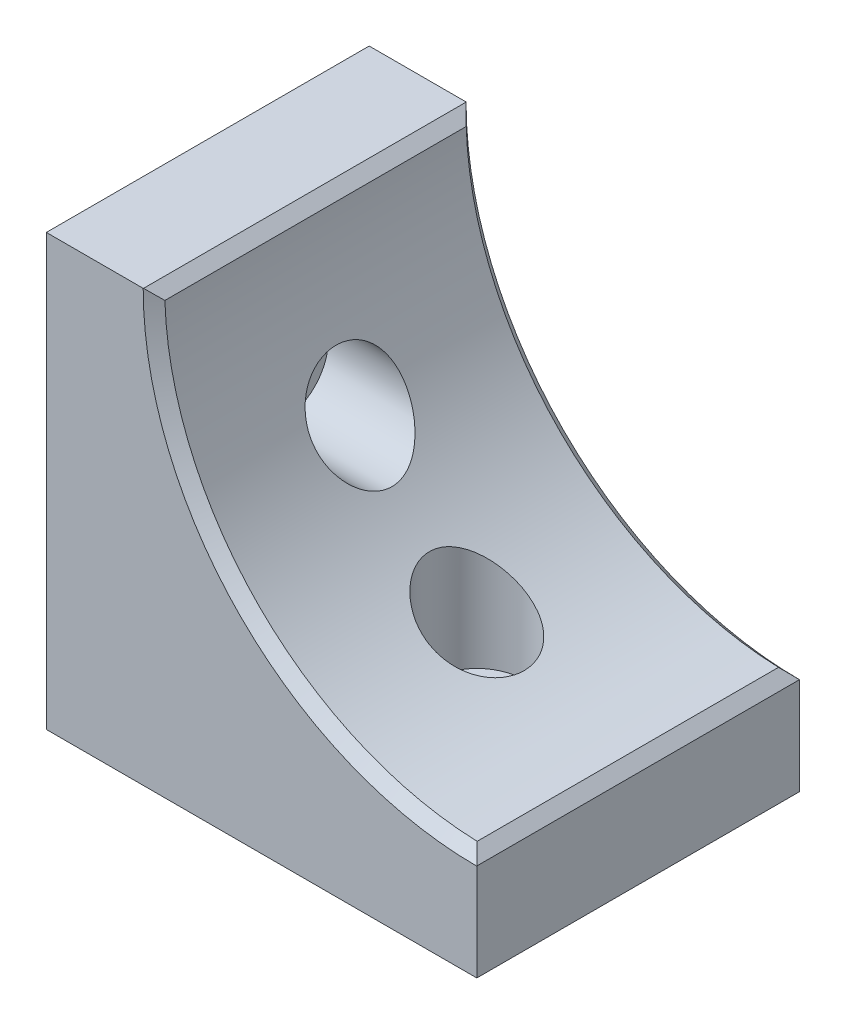
ISO-10303-21;
HEADER;
FILE_DESCRIPTION(('STEP AP214'),'2;1');
FILE_NAME('part.step','',(''),(''),'','','');
FILE_SCHEMA(('AUTOMOTIVE_DESIGN { 1 0 10303 214 1 1 1 1 }'));
ENDSEC;
DATA;
#1=APPLICATION_CONTEXT('core data for automotive mechanical design processes');
#2=APPLICATION_PROTOCOL_DEFINITION('international standard','automotive_design',2000,#1);
#3=PRODUCT_CONTEXT('',#1,'mechanical');
#4=PRODUCT('Part','Part','',(#3));
#5=PRODUCT_RELATED_PRODUCT_CATEGORY('part','',(#4));
#6=PRODUCT_DEFINITION_FORMATION('','',#4);
#7=PRODUCT_DEFINITION_CONTEXT('part definition',#1,'design');
#8=PRODUCT_DEFINITION('design','',#6,#7);
#9=PRODUCT_DEFINITION_SHAPE('','',#8);
#10=(LENGTH_UNIT() NAMED_UNIT(*) SI_UNIT(.MILLI.,.METRE.));
#11=(NAMED_UNIT(*) PLANE_ANGLE_UNIT() SI_UNIT($,.RADIAN.));
#12=(NAMED_UNIT(*) SI_UNIT($,.STERADIAN.) SOLID_ANGLE_UNIT());
#13=UNCERTAINTY_MEASURE_WITH_UNIT(LENGTH_MEASURE(1.E-05),#10,'distance_accuracy_value','');
#14=(GEOMETRIC_REPRESENTATION_CONTEXT(3) GLOBAL_UNCERTAINTY_ASSIGNED_CONTEXT((#13)) GLOBAL_UNIT_ASSIGNED_CONTEXT((#10,
#11,#12)) REPRESENTATION_CONTEXT('',''));
#15=CARTESIAN_POINT('',(0.,0.,0.));
#16=DIRECTION('',(0.,0.,1.));
#17=DIRECTION('',(1.,0.,0.));
#18=AXIS2_PLACEMENT_3D('',#15,#16,#17);
#19=CARTESIAN_POINT('',(50.8,50.8,0.));
#20=DIRECTION('',(0.,0.,1.));
#21=DIRECTION('',(1.,0.,0.));
#22=AXIS2_PLACEMENT_3D('',#19,#20,#21);
#23=PLANE('',#22);
#24=DIRECTION('',(-1.,0.,0.));
#25=VECTOR('',#24,1.);
#26=CARTESIAN_POINT('',(50.8,50.8,0.));
#27=LINE('',#26,#25);
#28=CARTESIAN_POINT('',(11.43,50.8,0.));
#29=VERTEX_POINT('',#28);
#30=CARTESIAN_POINT('',(0.,50.8,0.));
#31=VERTEX_POINT('',#30);
#32=EDGE_CURVE('E113',#29,#31,#27,.T.);
#33=ORIENTED_EDGE('',*,*,#32,.F.);
#34=CARTESIAN_POINT('',(50.8,50.8,0.));
#35=DIRECTION('',(0.,0.,1.));
#36=DIRECTION('',(1.,0.,0.));
#37=AXIS2_PLACEMENT_3D('',#34,#35,#36);
#38=CIRCLE('',#37,39.37);
#39=CARTESIAN_POINT('',(50.8,11.43,0.));
#40=VERTEX_POINT('',#39);
#41=EDGE_CURVE('E333',#29,#40,#38,.T.);
#42=ORIENTED_EDGE('',*,*,#41,.T.);
#43=DIRECTION('',(0.,-1.,0.));
#44=VECTOR('',#43,1.);
#45=CARTESIAN_POINT('',(50.8,50.8,0.));
#46=LINE('',#45,#44);
#47=CARTESIAN_POINT('',(50.8,0.,0.));
#48=VERTEX_POINT('',#47);
#49=EDGE_CURVE('E348',#40,#48,#46,.T.);
#50=ORIENTED_EDGE('',*,*,#49,.T.);
#51=DIRECTION('',(-1.,0.,0.));
#52=VECTOR('',#51,1.);
#53=CARTESIAN_POINT('',(50.8,0.,0.));
#54=LINE('',#53,#52);
#55=CARTESIAN_POINT('',(0.,0.,0.));
#56=VERTEX_POINT('',#55);
#57=EDGE_CURVE('E135',#48,#56,#54,.T.);
#58=ORIENTED_EDGE('',*,*,#57,.T.);
#59=DIRECTION('',(0.,-1.,0.));
#60=VECTOR('',#59,1.);
#61=CARTESIAN_POINT('',(0.,50.8,0.));
#62=LINE('',#61,#60);
#63=EDGE_CURVE('E127',#31,#56,#62,.T.);
#64=ORIENTED_EDGE('',*,*,#63,.F.);
#65=EDGE_LOOP('',(#33,#42,#50,#58,#64));
#66=FACE_BOUND('',#65,.T.);
#67=ADVANCED_FACE('F38',(#66),#23,.F.);
#68=CARTESIAN_POINT('',(0.,50.8,0.));
#69=DIRECTION('',(1.,0.,0.));
#70=DIRECTION('',(0.,0.,-1.));
#71=AXIS2_PLACEMENT_3D('',#68,#69,#70);
#72=PLANE('',#71);
#73=CARTESIAN_POINT('',(0.,31.75,19.05));
#74=DIRECTION('',(1.,0.,0.));
#75=DIRECTION('',(0.,0.,-1.));
#76=AXIS2_PLACEMENT_3D('',#73,#74,#75);
#77=CIRCLE('',#76,3.302);
#78=CARTESIAN_POINT('',(0.,31.75,15.748));
#79=VERTEX_POINT('',#78);
#80=EDGE_CURVE('E367',#79,#79,#77,.F.);
#81=ORIENTED_EDGE('',*,*,#80,.F.);
#82=EDGE_LOOP('',(#81));
#83=FACE_BOUND('',#82,.T.);
#84=DIRECTION('',(0.,0.,1.));
#85=VECTOR('',#84,1.);
#86=CARTESIAN_POINT('',(0.,0.,0.));
#87=LINE('',#86,#85);
#88=CARTESIAN_POINT('',(0.,0.,38.1));
#89=VERTEX_POINT('',#88);
#90=EDGE_CURVE('E356',#56,#89,#87,.T.);
#91=ORIENTED_EDGE('',*,*,#90,.T.);
#92=DIRECTION('',(0.,-1.,0.));
#93=VECTOR('',#92,1.);
#94=CARTESIAN_POINT('',(0.,50.8,38.1));
#95=LINE('',#94,#93);
#96=CARTESIAN_POINT('',(0.,50.8,38.1));
#97=VERTEX_POINT('',#96);
#98=EDGE_CURVE('E130',#97,#89,#95,.T.);
#99=ORIENTED_EDGE('',*,*,#98,.F.);
#100=DIRECTION('',(0.,0.,1.));
#101=VECTOR('',#100,1.);
#102=CARTESIAN_POINT('',(0.,50.8,0.));
#103=LINE('',#102,#101);
#104=EDGE_CURVE('E116',#31,#97,#103,.T.);
#105=ORIENTED_EDGE('',*,*,#104,.F.);
#106=ORIENTED_EDGE('',*,*,#63,.T.);
#107=EDGE_LOOP('',(#91,#99,#105,#106));
#108=FACE_BOUND('',#107,.T.);
#109=ADVANCED_FACE('F126',(#83,#108),#72,.F.);
#110=CARTESIAN_POINT('',(0.,50.8,38.1));
#111=DIRECTION('',(0.,0.,-1.));
#112=DIRECTION('',(-1.,0.,0.));
#113=AXIS2_PLACEMENT_3D('',#110,#111,#112);
#114=PLANE('',#113);
#115=DIRECTION('',(0.,-1.,0.));
#116=VECTOR('',#115,1.);
#117=CARTESIAN_POINT('',(50.8,50.8,38.1));
#118=LINE('',#117,#116);
#119=CARTESIAN_POINT('',(50.8,11.43,38.1));
#120=VERTEX_POINT('',#119);
#121=CARTESIAN_POINT('',(50.8,0.,38.1));
#122=VERTEX_POINT('',#121);
#123=EDGE_CURVE('E140',#120,#122,#118,.T.);
#124=ORIENTED_EDGE('',*,*,#123,.F.);
#125=CARTESIAN_POINT('',(50.8,50.8,38.1));
#126=DIRECTION('',(0.,0.,-1.));
#127=DIRECTION('',(-1.,0.,0.));
#128=AXIS2_PLACEMENT_3D('',#125,#126,#127);
#129=CIRCLE('',#128,39.37);
#130=CARTESIAN_POINT('',(11.43,50.8,38.1));
#131=VERTEX_POINT('',#130);
#132=EDGE_CURVE('E11',#120,#131,#129,.T.);
#133=ORIENTED_EDGE('',*,*,#132,.T.);
#134=DIRECTION('',(1.,0.,0.));
#135=VECTOR('',#134,1.);
#136=CARTESIAN_POINT('',(0.,50.8,38.1));
#137=LINE('',#136,#135);
#138=EDGE_CURVE('E132',#97,#131,#137,.T.);
#139=ORIENTED_EDGE('',*,*,#138,.F.);
#140=ORIENTED_EDGE('',*,*,#98,.T.);
#141=DIRECTION('',(1.,0.,0.));
#142=VECTOR('',#141,1.);
#143=CARTESIAN_POINT('',(0.,0.,38.1));
#144=LINE('',#143,#142);
#145=EDGE_CURVE('E354',#89,#122,#144,.T.);
#146=ORIENTED_EDGE('',*,*,#145,.T.);
#147=EDGE_LOOP('',(#124,#133,#139,#140,#146));
#148=FACE_BOUND('',#147,.T.);
#149=ADVANCED_FACE('F219',(#148),#114,.F.);
#150=CARTESIAN_POINT('',(50.8,50.8,38.1));
#151=DIRECTION('',(-1.,0.,0.));
#152=DIRECTION('',(0.,0.,1.));
#153=AXIS2_PLACEMENT_3D('',#150,#151,#152);
#154=PLANE('',#153);
#155=ORIENTED_EDGE('',*,*,#49,.F.);
#156=DIRECTION('',(0.,0.707106781186546,0.707106781186549));
#157=VECTOR('',#156,1.);
#158=CARTESIAN_POINT('',(50.8,50.8,39.3700000000002));
#159=LINE('',#158,#157);
#160=CARTESIAN_POINT('',(50.8,11.4504892025326,0.020489202532642));
#161=VERTEX_POINT('',#160);
#162=EDGE_CURVE('E342',#40,#161,#159,.T.);
#163=ORIENTED_EDGE('',*,*,#162,.T.);
#164=DIRECTION('',(0.,0.,1.));
#165=VECTOR('',#164,1.);
#166=CARTESIAN_POINT('',(50.8,11.4504892025326,38.1));
#167=LINE('',#166,#165);
#168=CARTESIAN_POINT('',(50.8,11.4504892025326,38.0795107974674));
#169=VERTEX_POINT('',#168);
#170=EDGE_CURVE('E138',#161,#169,#167,.T.);
#171=ORIENTED_EDGE('',*,*,#170,.T.);
#172=DIRECTION('',(0.,-0.707106781186547,0.707106781186548));
#173=VECTOR('',#172,1.);
#174=CARTESIAN_POINT('',(50.8,50.8,-1.26999999999999));
#175=LINE('',#174,#173);
#176=EDGE_CURVE('E136',#169,#120,#175,.T.);
#177=ORIENTED_EDGE('',*,*,#176,.T.);
#178=ORIENTED_EDGE('',*,*,#123,.T.);
#179=DIRECTION('',(0.,0.,-1.));
#180=VECTOR('',#179,1.);
#181=CARTESIAN_POINT('',(50.8,0.,38.1));
#182=LINE('',#181,#180);
#183=EDGE_CURVE('E122',#122,#48,#182,.T.);
#184=ORIENTED_EDGE('',*,*,#183,.T.);
#185=EDGE_LOOP('',(#155,#163,#171,#177,#178,#184));
#186=FACE_BOUND('',#185,.T.);
#187=ADVANCED_FACE('F224',(#186),#154,.F.);
#188=CARTESIAN_POINT('',(0.,50.8,0.));
#189=DIRECTION('',(0.,1.,0.));
#190=DIRECTION('',(0.,0.,1.));
#191=AXIS2_PLACEMENT_3D('',#188,#189,#190);
#192=PLANE('',#191);
#193=DIRECTION('',(0.,0.,-1.));
#194=VECTOR('',#193,1.);
#195=CARTESIAN_POINT('',(11.4504892025327,50.8,0.));
#196=LINE('',#195,#194);
#197=CARTESIAN_POINT('',(11.4504892025327,50.8,38.0795107974674));
#198=VERTEX_POINT('',#197);
#199=CARTESIAN_POINT('',(11.4504892025327,50.8,0.0204892025326421));
#200=VERTEX_POINT('',#199);
#201=EDGE_CURVE('E61',#198,#200,#196,.T.);
#202=ORIENTED_EDGE('',*,*,#201,.T.);
#203=DIRECTION('',(0.707106781186546,0.,0.707106781186549));
#204=VECTOR('',#203,1.);
#205=CARTESIAN_POINT('',(50.8,50.8,39.3700000000002));
#206=LINE('',#205,#204);
#207=EDGE_CURVE('E53',#200,#29,#206,.F.);
#208=ORIENTED_EDGE('',*,*,#207,.T.);
#209=ORIENTED_EDGE('',*,*,#32,.T.);
#210=ORIENTED_EDGE('',*,*,#104,.T.);
#211=ORIENTED_EDGE('',*,*,#138,.T.);
#212=DIRECTION('',(-0.707106781186547,0.,0.707106781186548));
#213=VECTOR('',#212,1.);
#214=CARTESIAN_POINT('',(50.8,50.8,-1.26999999999999));
#215=LINE('',#214,#213);
#216=EDGE_CURVE('E66',#131,#198,#215,.F.);
#217=ORIENTED_EDGE('',*,*,#216,.T.);
#218=EDGE_LOOP('',(#202,#208,#209,#210,#211,#217));
#219=FACE_BOUND('',#218,.T.);
#220=ADVANCED_FACE('F115',(#219),#192,.T.);
#221=CARTESIAN_POINT('',(0.,0.,0.));
#222=DIRECTION('',(0.,1.,0.));
#223=DIRECTION('',(0.,0.,1.));
#224=AXIS2_PLACEMENT_3D('',#221,#222,#223);
#225=PLANE('',#224);
#226=CARTESIAN_POINT('',(31.75,0.,19.05));
#227=DIRECTION('',(0.,1.,0.));
#228=DIRECTION('',(0.,0.,1.));
#229=AXIS2_PLACEMENT_3D('',#226,#227,#228);
#230=CIRCLE('',#229,3.302);
#231=CARTESIAN_POINT('',(31.75,0.,22.352));
#232=VERTEX_POINT('',#231);
#233=EDGE_CURVE('E153',#232,#232,#230,.F.);
#234=ORIENTED_EDGE('',*,*,#233,.F.);
#235=EDGE_LOOP('',(#234));
#236=FACE_BOUND('',#235,.T.);
#237=ORIENTED_EDGE('',*,*,#57,.F.);
#238=ORIENTED_EDGE('',*,*,#183,.F.);
#239=ORIENTED_EDGE('',*,*,#145,.F.);
#240=ORIENTED_EDGE('',*,*,#90,.F.);
#241=EDGE_LOOP('',(#237,#238,#239,#240));
#242=FACE_BOUND('',#241,.T.);
#243=ADVANCED_FACE('F232',(#236,#242),#225,.F.);
#244=CARTESIAN_POINT('',(31.75,8.63599999999999,19.05));
#245=DIRECTION('',(0.,1.,0.));
#246=DIRECTION('',(0.,0.,1.));
#247=AXIS2_PLACEMENT_3D('',#244,#245,#246);
#248=CYLINDRICAL_SURFACE('',#247,5.588);
#249=CARTESIAN_POINT('',(31.75,8.63599999999999,19.05));
#250=DIRECTION('',(0.,1.,0.));
#251=DIRECTION('',(0.,0.,1.));
#252=AXIS2_PLACEMENT_3D('',#249,#250,#251);
#253=CIRCLE('',#252,5.588);
#254=CARTESIAN_POINT('',(31.75,8.63599999999999,24.638));
#255=VERTEX_POINT('',#254);
#256=EDGE_CURVE('E152',#255,#255,#253,.T.);
#257=ORIENTED_EDGE('',*,*,#256,.F.);
#258=EDGE_LOOP('',(#257));
#259=FACE_BOUND('',#258,.T.);
#260=CARTESIAN_POINT('',(33.6719798439574,16.7670611681242,13.8029305817989));
#261=CARTESIAN_POINT('',(33.5045353280294,16.8513310136074,13.7415942827989));
#262=CARTESIAN_POINT('',(33.3352937266387,16.9380603812287,13.6886964796672));
#263=CARTESIAN_POINT('',(32.9946795607733,17.1159166737783,13.5995401492416));
#264=CARTESIAN_POINT('',(32.8233063541464,17.2070449489363,13.5632867672505));
#265=CARTESIAN_POINT('',(32.479775894432,17.3931508591966,13.5071225590476));
#266=CARTESIAN_POINT('',(32.3076180645864,17.4881319623945,13.4872268156782));
#267=CARTESIAN_POINT('',(31.9639354053222,17.6812494966506,13.4634377214319));
#268=CARTESIAN_POINT('',(31.7924108605644,17.7793871902659,13.4595508559772));
#269=CARTESIAN_POINT('',(31.2822756470434,18.0765804804548,13.4712716163644));
#270=CARTESIAN_POINT('',(30.9461809831672,18.2794574455061,13.5099599225219));
#271=CARTESIAN_POINT('',(30.2890471204666,18.6898595169805,13.6459190832213));
#272=CARTESIAN_POINT('',(29.968012180294,18.8973859139663,13.7432064022736));
#273=CARTESIAN_POINT('',(29.4891690133239,19.2167787236106,13.9365348403208));
#274=CARTESIAN_POINT('',(29.3235921599779,19.3291803377568,14.012976848834));
#275=CARTESIAN_POINT('',(28.9999294204498,19.5525096115123,14.1821229911969));
#276=CARTESIAN_POINT('',(28.8418445252106,19.6634370747508,14.274829268699));
#277=CARTESIAN_POINT('',(28.3806086058974,19.9921686219119,14.5769834831149));
#278=CARTESIAN_POINT('',(28.0899830629529,20.2062533020605,14.8106645329883));
#279=CARTESIAN_POINT('',(27.6145771636137,20.5656769122043,15.2805066981059));
#280=CARTESIAN_POINT('',(27.4207368377338,20.7155991137379,15.5041000222447));
#281=CARTESIAN_POINT('',(27.0662413838408,20.9944753592773,15.987691813407));
#282=CARTESIAN_POINT('',(26.9055350408927,21.1234616970082,16.2476330379277));
#283=CARTESIAN_POINT('',(26.6516193745438,21.3298896004888,16.7488114930517));
#284=CARTESIAN_POINT('',(26.5513956758244,21.4124647882096,16.9843214560591));
#285=CARTESIAN_POINT('',(26.4249501562238,21.5174125596772,17.3510689076288));
#286=CARTESIAN_POINT('',(26.3867772968931,21.5492477885212,17.4755953072772));
#287=CARTESIAN_POINT('',(26.3189421849793,21.6059976768297,17.7284619934944));
#288=CARTESIAN_POINT('',(26.2892762685749,21.6309153154557,17.8568006118317));
#289=CARTESIAN_POINT('',(26.2387811232252,21.6734206198714,18.1172990627839));
#290=CARTESIAN_POINT('',(26.2180110288742,21.6909592206228,18.2494784140243));
#291=CARTESIAN_POINT('',(26.1859759796516,21.71804228522,18.5158037532267));
#292=CARTESIAN_POINT('',(26.1747110266998,21.7275867474511,18.649949741586));
#293=CARTESIAN_POINT('',(26.1619129645557,21.7384319316339,18.9190021543603));
#294=CARTESIAN_POINT('',(26.1603771597571,21.7397349370045,19.0539083577774));
#295=CARTESIAN_POINT('',(26.1670611883183,21.7340690041884,19.3232957800423));
#296=CARTESIAN_POINT('',(26.175280323829,21.7271006577179,19.4577770286005));
#297=CARTESIAN_POINT('',(26.1999871654489,21.7061931162384,19.7115630160486));
#298=CARTESIAN_POINT('',(26.2155515319246,21.6930327491756,19.8310234377406));
#299=CARTESIAN_POINT('',(26.2541747473494,21.660454873472,20.0678755756412));
#300=CARTESIAN_POINT('',(26.2772360708962,21.6410352988082,20.1852665952743));
#301=CARTESIAN_POINT('',(26.3571847940822,21.5739208484998,20.533163954169));
#302=CARTESIAN_POINT('',(26.4248578338043,21.5173523011462,20.7596015839899));
#303=CARTESIAN_POINT('',(26.5898490361349,21.3807796837398,21.2084430814242));
#304=CARTESIAN_POINT('',(26.6885505195984,21.2996907069803,21.4299943199561));
#305=CARTESIAN_POINT('',(26.9099911671664,21.1200761073255,21.8530645645592));
#306=CARTESIAN_POINT('',(27.0327486021475,21.0215372364733,22.0545681676422));
#307=CARTESIAN_POINT('',(27.3599589505764,20.7627681286684,22.5239817824309));
#308=CARTESIAN_POINT('',(27.5760116570853,20.5950150026524,22.7797828624883));
#309=CARTESIAN_POINT('',(27.9254451654776,20.330566506813,23.1274576589672));
#310=CARTESIAN_POINT('',(28.0463047874658,20.2401674301591,23.2374521247969));
#311=CARTESIAN_POINT('',(28.2956425915957,20.0560914689852,23.44539464529));
#312=CARTESIAN_POINT('',(28.424120119988,19.9624148660162,23.5433437314461));
#313=CARTESIAN_POINT('',(28.8229154418719,19.6756480024731,23.8211266646407));
#314=CARTESIAN_POINT('',(29.1039459927729,19.4788428288185,23.9822863378972));
#315=CARTESIAN_POINT('',(29.5413766744913,19.1817724996902,24.1855257260071));
#316=CARTESIAN_POINT('',(29.6898746302208,19.0824128244681,24.2468663261037));
#317=CARTESIAN_POINT('',(29.9916378909298,18.883630772773,24.3565678442023));
#318=CARTESIAN_POINT('',(30.1449036733369,18.7842083910038,24.4049274576507));
#319=CARTESIAN_POINT('',(30.4769255947701,18.5722691549849,24.4941283786566));
#320=CARTESIAN_POINT('',(30.6562721068778,18.4598459113109,24.5330006822198));
#321=CARTESIAN_POINT('',(31.0189156298771,18.2367692327839,24.5930156523691));
#322=CARTESIAN_POINT('',(31.2022113713998,18.1261152486007,24.6141639311543));
#323=CARTESIAN_POINT('',(31.5716968319901,17.9073186080819,24.6382244553069));
#324=CARTESIAN_POINT('',(31.757888783893,17.7991780678226,24.6411218524643));
#325=CARTESIAN_POINT('',(32.1315024847891,17.5863976038308,24.6280925538605));
#326=CARTESIAN_POINT('',(32.3189235424427,17.4817558854521,24.612175665658));
#327=CARTESIAN_POINT('',(32.6886196064006,17.2793921488504,24.5616815555394));
#328=CARTESIAN_POINT('',(32.8709020637448,17.181561069782,24.5275987733002));
#329=CARTESIAN_POINT('',(33.2334251985698,16.9907204687633,24.4407247186672));
#330=CARTESIAN_POINT('',(33.4136668700046,16.897708513117,24.3879429970547));
#331=CARTESIAN_POINT('',(33.7702435446701,16.7171991676075,24.263444592495));
#332=CARTESIAN_POINT('',(33.9465802630183,16.6296993242837,24.1917364086068));
#333=CARTESIAN_POINT('',(34.2933535990997,16.4608415676439,24.0293308764034));
#334=CARTESIAN_POINT('',(34.463791130951,16.3794827004148,23.9386364856177));
#335=CARTESIAN_POINT('',(34.7772887876459,16.2325419981447,23.7500797975986));
#336=CARTESIAN_POINT('',(34.9212349202742,16.1662238696086,23.6542609017718));
#337=CARTESIAN_POINT('',(35.2011730828357,16.0392431895015,23.4483325158939));
#338=CARTESIAN_POINT('',(35.3371662954564,15.9785797962075,23.3382251585751));
#339=CARTESIAN_POINT('',(35.5995014515075,15.8632661633133,23.104373287349));
#340=CARTESIAN_POINT('',(35.7258489635187,15.8086124461043,22.9806367440918));
#341=CARTESIAN_POINT('',(35.9673563007142,15.7055571126729,22.7203081643082));
#342=CARTESIAN_POINT('',(36.0825173730485,15.6571547992974,22.5837175642011));
#343=CARTESIAN_POINT('',(36.2875755887621,15.5720223000897,22.315168368058));
#344=CARTESIAN_POINT('',(36.3788550120753,15.5345899110446,22.184484956127));
#345=CARTESIAN_POINT('',(36.5504376114816,15.4649105259815,21.9147997196267));
#346=CARTESIAN_POINT('',(36.630741894007,15.4326630072055,21.7757987356075));
#347=CARTESIAN_POINT('',(36.779443053768,15.3734507644041,21.4905549401246));
#348=CARTESIAN_POINT('',(36.8478440628736,15.3464842068398,21.3443146642993));
#349=CARTESIAN_POINT('',(36.9719795625175,15.2978831724994,21.0456988952552));
#350=CARTESIAN_POINT('',(37.0277145806201,15.2762484736372,20.8933236578814));
#351=CARTESIAN_POINT('',(37.1224133885566,15.2396848215849,20.5945783005061));
#352=CARTESIAN_POINT('',(37.1622802554007,15.2243915772057,20.44853822312));
#353=CARTESIAN_POINT('',(37.230089583053,15.198471215687,20.153312152632));
#354=CARTESIAN_POINT('',(37.2580326460314,15.187843862912,20.0041263187949));
#355=CARTESIAN_POINT('',(37.3017013647577,15.1712688919853,19.7037479334325));
#356=CARTESIAN_POINT('',(37.3174292109676,15.1653204348002,19.5525557466391));
#357=CARTESIAN_POINT('',(37.336511873042,15.1581062125375,19.2492806263582));
#358=CARTESIAN_POINT('',(37.3398667869517,15.1568404103538,19.0971976999385));
#359=CARTESIAN_POINT('',(37.3342530148954,15.1589609499622,18.7977598191406));
#360=CARTESIAN_POINT('',(37.3256429307956,15.162211919406,18.6503970352189));
#361=CARTESIAN_POINT('',(37.2968132686684,15.1731255156665,18.3569254767016));
#362=CARTESIAN_POINT('',(37.2765897858464,15.1807896263241,18.2108171406702));
#363=CARTESIAN_POINT('',(37.2247401627678,15.2005184334756,17.9210072153773));
#364=CARTESIAN_POINT('',(37.1931189925873,15.2125812119128,17.7773046056119));
#365=CARTESIAN_POINT('',(37.1187674682408,15.241098718281,17.4931924060241));
#366=CARTESIAN_POINT('',(37.0760330006639,15.2575550724846,17.3527840565432));
#367=CARTESIAN_POINT('',(36.9798802316746,15.2948321306295,17.0762934665307));
#368=CARTESIAN_POINT('',(36.9264632640266,15.3156522897432,16.9402106883854));
#369=CARTESIAN_POINT('',(36.8094317626486,15.3616316452543,16.6732060898335));
#370=CARTESIAN_POINT('',(36.7458135313782,15.3867924151973,16.5422861622684));
#371=CARTESIAN_POINT('',(36.6090098542305,15.441391173675,16.2865249737404));
#372=CARTESIAN_POINT('',(36.5358269027572,15.4708280472578,16.1616821395292));
#373=CARTESIAN_POINT('',(36.3805270635381,15.5339281312618,15.9187452855139));
#374=CARTESIAN_POINT('',(36.2984068862207,15.5675928985727,15.8006537752657));
#375=CARTESIAN_POINT('',(36.12363392523,15.6400303561165,15.5688054598487));
#376=CARTESIAN_POINT('',(36.0307547788586,15.6789174166269,15.4552550507083));
#377=CARTESIAN_POINT('',(35.837181505224,15.7609486952775,15.2365995436409));
#378=CARTESIAN_POINT('',(35.7364843580261,15.8040945602711,15.1314977414675));
#379=CARTESIAN_POINT('',(35.5282451448907,15.89446508193,14.930346265392));
#380=CARTESIAN_POINT('',(35.4207071020827,15.9416873469938,14.8342913519818));
#381=CARTESIAN_POINT('',(35.1996255956112,16.0400663819765,14.6515436690519));
#382=CARTESIAN_POINT('',(35.0860805125648,16.0912242145545,14.5648534434293));
#383=CARTESIAN_POINT('',(34.7662893928273,16.2373017134574,14.3393984739019));
#384=CARTESIAN_POINT('',(34.5546796827127,16.3361419827205,14.2106349392047));
#385=CARTESIAN_POINT('',(34.120464968254,16.5441817938068,13.9837679627413));
#386=CARTESIAN_POINT('',(33.8978575027763,16.6533836594803,13.8856714201115));
#387=CARTESIAN_POINT('',(33.6719798439574,16.7670611681242,13.8029305817989));
#388=B_SPLINE_CURVE_WITH_KNOTS('',3,(#260,#261,#262,#263,#264,#265,#266,#267,#268,#269,#270,
#271,#272,#273,#274,#275,#276,#277,#278,#279,#280,#281,#282,#283,#284,#285,#286,#287,#288,#289,
#290,#291,#292,#293,#294,#295,#296,#297,#298,#299,#300,#301,#302,#303,#304,#305,#306,#307,#308,
#309,#310,#311,#312,#313,#314,#315,#316,#317,#318,#319,#320,#321,#322,#323,#324,#325,#326,#327,
#328,#329,#330,#331,#332,#333,#334,#335,#336,#337,#338,#339,#340,#341,#342,#343,#344,#345,#346,
#347,#348,#349,#350,#351,#352,#353,#354,#355,#356,#357,#358,#359,#360,#361,#362,#363,#364,#365,
#366,#367,#368,#369,#370,#371,#372,#373,#374,#375,#376,#377,#378,#379,#380,#381,#382,#383,#384,
#385,#386,#387),.UNSPECIFIED.,.T.,.F.,(4,2,2,2,2,2,2,2,2,2,2,2,2,2,2,2,2,2,2,2,2,2,2,2,2,2,2,2,
2,2,2,2,2,2,2,2,2,2,2,2,2,2,2,2,2,2,2,2,2,2,2,2,2,2,2,2,2,2,2,2,2,2,2,4),(0.,0.59143019743791,
1.18304310125731,1.77520090208599,2.36759857081314,3.54585146252315,4.72443556138375,
5.36642340974752,6.00849593662644,7.29078496302428,8.28242618747284,9.27252295480576,
10.0757784277186,10.4775908666943,10.8792299898642,11.2834990460044,11.6877681837963,
12.0919253078656,12.4960535210771,12.8591869552194,13.2224403744609,13.9483281951731,
14.7127598966768,15.4777744623373,16.5948096200641,17.1546365229015,17.7144154521549,
18.8465445116787,19.4129005516023,19.9793134874643,20.6241765766427,21.268835396813,
21.9140186187461,22.5588656661881,23.1869959575326,23.8148058827761,24.4423343638679,
25.0697651659001,25.6246023338844,26.1793567805023,26.7337884999131,27.2881583359105,
27.7787455566503,28.269283283489,28.7596503935079,29.2499970749936,29.7058994237187,
30.1617787459571,30.6175762999307,31.0733702420838,31.5157943669071,31.9583673359779,
32.400747549666,32.8432917370011,33.2857807049057,33.7284304209991,34.1709649270054,
34.6136628734421,35.0684483688447,35.5234104211416,35.9781073406027,36.4329274685207,
37.2305698522643,38.0283915522569),.UNSPECIFIED.);
#389=CARTESIAN_POINT('',(33.6719798439574,16.7670611681242,13.8029305817989));
#390=VERTEX_POINT('',#389);
#391=EDGE_CURVE('E144',#390,#390,#388,.T.);
#392=ORIENTED_EDGE('',*,*,#391,.T.);
#393=EDGE_LOOP('',(#392));
#394=FACE_BOUND('',#393,.T.);
#395=ADVANCED_FACE('F159',(#259,#394),#248,.F.);
#396=CARTESIAN_POINT('',(31.75,8.63599999999999,19.05));
#397=DIRECTION('',(0.,1.,0.));
#398=DIRECTION('',(0.,0.,1.));
#399=AXIS2_PLACEMENT_3D('',#396,#397,#398);
#400=PLANE('',#399);
#401=CARTESIAN_POINT('',(31.75,8.63599999999999,19.05));
#402=DIRECTION('',(0.,1.,0.));
#403=DIRECTION('',(0.,0.,1.));
#404=AXIS2_PLACEMENT_3D('',#401,#402,#403);
#405=CIRCLE('',#404,3.302);
#406=CARTESIAN_POINT('',(31.75,8.63599999999999,22.352));
#407=VERTEX_POINT('',#406);
#408=EDGE_CURVE('E377',#407,#407,#405,.T.);
#409=ORIENTED_EDGE('',*,*,#408,.F.);
#410=EDGE_LOOP('',(#409));
#411=FACE_BOUND('',#410,.T.);
#412=ORIENTED_EDGE('',*,*,#256,.T.);
#413=EDGE_LOOP('',(#412));
#414=FACE_BOUND('',#413,.T.);
#415=ADVANCED_FACE('F252',(#411,#414),#400,.T.);
#416=CARTESIAN_POINT('',(31.75,-9.33946636591192,19.05));
#417=DIRECTION('',(0.,1.,0.));
#418=DIRECTION('',(0.,0.,1.));
#419=AXIS2_PLACEMENT_3D('',#416,#417,#418);
#420=CYLINDRICAL_SURFACE('',#419,3.302);
#421=ORIENTED_EDGE('',*,*,#233,.T.);
#422=EDGE_LOOP('',(#421));
#423=FACE_BOUND('',#422,.T.);
#424=ORIENTED_EDGE('',*,*,#408,.T.);
#425=EDGE_LOOP('',(#424));
#426=FACE_BOUND('',#425,.T.);
#427=ADVANCED_FACE('F260',(#423,#426),#420,.F.);
#428=CARTESIAN_POINT('',(8.63600000000001,31.75,19.05));
#429=DIRECTION('',(1.,0.,0.));
#430=DIRECTION('',(0.,1.,0.));
#431=AXIS2_PLACEMENT_3D('',#428,#429,#430);
#432=CYLINDRICAL_SURFACE('',#431,5.588);
#433=CARTESIAN_POINT('',(8.63600000000001,31.75,19.05));
#434=DIRECTION('',(1.,0.,0.));
#435=DIRECTION('',(0.,1.,0.));
#436=AXIS2_PLACEMENT_3D('',#433,#434,#435);
#437=CIRCLE('',#436,5.588);
#438=CARTESIAN_POINT('',(8.63600000000001,37.338,19.05));
#439=VERTEX_POINT('',#438);
#440=EDGE_CURVE('E374',#439,#439,#437,.T.);
#441=ORIENTED_EDGE('',*,*,#440,.F.);
#442=EDGE_LOOP('',(#441));
#443=FACE_BOUND('',#442,.T.);
#444=CARTESIAN_POINT('',(21.7383593718455,26.162,19.05));
#445=CARTESIAN_POINT('',(21.7383586875106,26.1620006660003,18.9177045674628));
#446=CARTESIAN_POINT('',(21.7343673278962,26.1667064415382,18.7853994247058));
#447=CARTESIAN_POINT('',(21.7185010214289,26.185439992986,18.5219235390432));
#448=CARTESIAN_POINT('',(21.7066252778519,26.1994687109877,18.3907529121385));
#449=CARTESIAN_POINT('',(21.6752770063286,26.2365902514015,18.1305816012309));
#450=CARTESIAN_POINT('',(21.6558018542545,26.259686204809,18.0015816828562));
#451=CARTESIAN_POINT('',(21.609695371419,26.3145472425116,17.7466952799846));
#452=CARTESIAN_POINT('',(21.5830608611591,26.34631617861,17.6208102059935));
#453=CARTESIAN_POINT('',(21.5234035702063,26.4177718627034,17.3738442100198));
#454=CARTESIAN_POINT('',(21.490425322762,26.4574034719834,17.2527365042607));
#455=CARTESIAN_POINT('',(21.418576706886,26.544173125129,17.0150210626177));
#456=CARTESIAN_POINT('',(21.3797040977341,26.5913140239697,16.8984150592795));
#457=CARTESIAN_POINT('',(21.2551978588359,26.7431549009496,16.5561067037991));
#458=CARTESIAN_POINT('',(21.1616530853198,26.8583000015064,16.3378229245621));
#459=CARTESIAN_POINT('',(20.9221576367991,27.1573910990206,15.8496086902584));
#460=CARTESIAN_POINT('',(20.7694271321817,27.3512174580173,15.5891102244511));
#461=CARTESIAN_POINT('',(20.444697423757,27.7731324965075,15.1114666370565));
#462=CARTESIAN_POINT('',(20.2726728038349,28.0012665074239,14.8943797737807));
#463=CARTESIAN_POINT('',(19.9149691944531,28.4881770406213,14.5018800591389));
#464=CARTESIAN_POINT('',(19.7291337032238,28.7473352596798,14.3270881129404));
#465=CARTESIAN_POINT('',(19.3523092571798,29.2881146361933,14.0239802440538));
#466=CARTESIAN_POINT('',(19.1613205230293,29.5697348328232,13.8956623347093));
#467=CARTESIAN_POINT('',(18.8587916106819,30.0295711715485,13.7303745725852));
#468=CARTESIAN_POINT('',(18.7471593781745,30.2022209345799,13.6775921595502));
#469=CARTESIAN_POINT('',(18.5248365171003,30.5523645376023,13.5888638643632));
#470=CARTESIAN_POINT('',(18.4141456263784,30.7298569668691,13.5529131332156));
#471=CARTESIAN_POINT('',(18.1944629029496,31.0887524744179,13.498290467899));
#472=CARTESIAN_POINT('',(18.0854728137472,31.2701591627489,13.479635248823));
#473=CARTESIAN_POINT('',(17.8701757083986,31.6354081747579,13.4601843842692));
#474=CARTESIAN_POINT('',(17.7638674657137,31.8192493241426,13.4593804210091));
#475=CARTESIAN_POINT('',(17.5542280594255,32.1888746915521,13.476176618339));
#476=CARTESIAN_POINT('',(17.4509120108267,32.3746638963777,13.4938575736686));
#477=CARTESIAN_POINT('',(17.2485870087164,32.7457120844563,13.5482331441175));
#478=CARTESIAN_POINT('',(17.1495760375326,32.930971277235,13.5849187458556));
#479=CARTESIAN_POINT('',(16.9566112241204,33.2991935231791,13.6776841419251));
#480=CARTESIAN_POINT('',(16.8626556754218,33.4821573349602,13.7337573438589));
#481=CARTESIAN_POINT('',(16.6805110277813,33.8438373313091,13.8655407358838));
#482=CARTESIAN_POINT('',(16.5923210857167,34.0225541344863,13.9412480467398));
#483=CARTESIAN_POINT('',(16.4312410111168,34.355276007233,14.103397143445));
#484=CARTESIAN_POINT('',(16.3577137045394,34.5099175080847,14.187902444592));
#485=CARTESIAN_POINT('',(16.2162994335247,34.8123326053102,14.372475989495));
#486=CARTESIAN_POINT('',(16.1484116026568,34.9601072551416,14.47254183577));
#487=CARTESIAN_POINT('',(16.0187201773425,35.2469506918816,14.6877518096167));
#488=CARTESIAN_POINT('',(15.9569127674804,35.3860249180281,14.8028863746042));
#489=CARTESIAN_POINT('',(15.8396923956463,35.6537710700419,15.0476013694194));
#490=CARTESIAN_POINT('',(15.7842786115535,35.7824443326725,15.1771799377509));
#491=CARTESIAN_POINT('',(15.6864562585161,36.0127501930271,15.4332796579284));
#492=CARTESIAN_POINT('',(15.6432854854474,36.115769686914,15.5582659253627));
#493=CARTESIAN_POINT('',(15.5622649518314,36.3112724450761,15.8178293478051));
#494=CARTESIAN_POINT('',(15.5244145812895,36.4037569169816,15.9524054006549));
#495=CARTESIAN_POINT('',(15.4541705817098,36.5770927389522,16.2301233654312));
#496=CARTESIAN_POINT('',(15.4217748110335,36.6579486529089,16.3732618854201));
#497=CARTESIAN_POINT('',(15.3625142938719,36.8071070531144,16.6670305364275));
#498=CARTESIAN_POINT('',(15.335649248716,36.8754102172164,16.8176602623597));
#499=CARTESIAN_POINT('',(15.2894613360314,36.9936485606197,17.1127145218814));
#500=CARTESIAN_POINT('',(15.2697042712073,37.0446223620771,17.2566559980601));
#501=CARTESIAN_POINT('',(15.2349492228331,37.13473385984,17.5487534832474));
#502=CARTESIAN_POINT('',(15.2199509472907,37.1738722823398,17.6969092330664));
#503=CARTESIAN_POINT('',(15.1947365930556,37.2398942477128,17.9962928676373));
#504=CARTESIAN_POINT('',(15.1845195018087,37.2667803853305,18.1475200948301));
#505=CARTESIAN_POINT('',(15.1688749194885,37.3080240831949,18.4519193485865));
#506=CARTESIAN_POINT('',(15.1634473662509,37.3223818060501,18.6050913498823));
#507=CARTESIAN_POINT('',(15.1575001818881,37.338117793218,18.9064723715693));
#508=CARTESIAN_POINT('',(15.1568054386301,37.3399591523161,19.0546539803111));
#509=CARTESIAN_POINT('',(15.1598617446968,37.3318685637955,19.3507007040783));
#510=CARTESIAN_POINT('',(15.1636142847391,37.3219326684721,19.4985656963271));
#511=CARTESIAN_POINT('',(15.1755614354896,37.2903863793776,19.7927954507247));
#512=CARTESIAN_POINT('',(15.1837540547042,37.2687812195969,19.9391608555127));
#513=CARTESIAN_POINT('',(15.2045752844343,37.2141031208859,20.2294685376912));
#514=CARTESIAN_POINT('',(15.2172055343933,37.1810259437786,20.3734098989168));
#515=CARTESIAN_POINT('',(15.2467962308614,37.1039643502261,20.6569418108893));
#516=CARTESIAN_POINT('',(15.2637300696764,37.0600470013864,20.7965533849704));
#517=CARTESIAN_POINT('',(15.3019470388044,36.961610565734,21.0714299009709));
#518=CARTESIAN_POINT('',(15.3232317387523,36.9070876531585,21.2066932537698));
#519=CARTESIAN_POINT('',(15.3701019746593,36.7879902666948,21.4718831855676));
#520=CARTESIAN_POINT('',(15.3956859516946,36.7234194368209,21.6018116778207));
#521=CARTESIAN_POINT('',(15.451119216009,36.5847898629772,21.8556136678954));
#522=CARTESIAN_POINT('',(15.4809700963943,36.5107275763166,21.9794848808614));
#523=CARTESIAN_POINT('',(15.545527660232,36.3521747261095,22.2228954269683));
#524=CARTESIAN_POINT('',(15.5803225446569,36.267499063024,22.342290763468));
#525=CARTESIAN_POINT('',(15.6541971046339,36.0897381568388,22.5733034758468));
#526=CARTESIAN_POINT('',(15.6932783337939,35.9966498667045,22.6849180073984));
#527=CARTESIAN_POINT('',(15.7755876458739,35.8029467613358,22.8997110292248));
#528=CARTESIAN_POINT('',(15.8188146786728,35.7023338534812,23.0028916435876));
#529=CARTESIAN_POINT('',(15.9092971428974,35.4943893101994,23.2004057437594));
#530=CARTESIAN_POINT('',(15.9565540866266,35.3870551565425,23.2947358801144));
#531=CARTESIAN_POINT('',(16.057472145539,35.1608548664438,23.4787866815643));
#532=CARTESIAN_POINT('',(16.1113381995986,35.0416793753548,23.5680154225793));
#533=CARTESIAN_POINT('',(16.2231166716996,34.7979009475991,23.735934672391));
#534=CARTESIAN_POINT('',(16.2810305668633,34.673296035962,23.8146213033273));
#535=CARTESIAN_POINT('',(16.4604748402923,34.2928713001211,24.0344957338758));
#536=CARTESIAN_POINT('',(16.5877743344666,34.0302911149214,24.1596190010606));
#537=CARTESIAN_POINT('',(16.867066083307,33.4716457386206,24.3753283362226));
#538=CARTESIAN_POINT('',(17.0202440012662,33.174659371058,24.4619417666154));
#539=CARTESIAN_POINT('',(17.338906778081,32.5769348597159,24.5848979361822));
#540=CARTESIAN_POINT('',(17.5043965755019,32.2761952511241,24.6212203867249));
#541=CARTESIAN_POINT('',(17.8636838470674,31.6439119699508,24.6469327174045));
#542=CARTESIAN_POINT('',(18.0585619510286,31.3127478994585,24.6305253910363));
#543=CARTESIAN_POINT('',(18.4547244791997,30.6620111913205,24.5409070530243));
#544=CARTESIAN_POINT('',(18.656013564466,30.3424473662008,24.4676537641403));
#545=CARTESIAN_POINT('',(19.0804366019948,29.6896755322377,24.2567487015107));
#546=CARTESIAN_POINT('',(19.3036973443094,29.3584197723145,24.1132720282178));
#547=CARTESIAN_POINT('',(19.7435618846503,28.7261275463232,23.7630180788905));
#548=CARTESIAN_POINT('',(19.9601666334815,28.4250867500105,23.5562498907026));
#549=CARTESIAN_POINT('',(20.3403569173087,27.911045608012,23.1219790980775));
#550=CARTESIAN_POINT('',(20.5066415526677,27.6918171278576,22.9042116292874));
#551=CARTESIAN_POINT('',(20.8196921428414,27.2871023299853,22.4272586836336));
#552=CARTESIAN_POINT('',(20.9664848623572,27.1015696124487,22.1681310993489));
#553=CARTESIAN_POINT('',(21.2037264832656,26.8062720400458,21.6675385209377));
#554=CARTESIAN_POINT('',(21.2995603562915,26.6887716668368,21.43326018979));
#555=CARTESIAN_POINT('',(21.4248207680713,26.5365880437499,21.065858548549));
#556=CARTESIAN_POINT('',(21.4634877656005,26.4898769124956,20.940748749403));
#557=CARTESIAN_POINT('',(21.5339612077969,26.4050821453614,20.6857342893435));
#558=CARTESIAN_POINT('',(21.5657686200551,26.3669972926483,20.5558303077135));
#559=CARTESIAN_POINT('',(21.6173015037678,26.3054812733478,20.313327056982));
#560=CARTESIAN_POINT('',(21.6381478531609,26.2806778458536,20.2013111793757));
#561=CARTESIAN_POINT('',(21.6741655874373,26.2379041269802,19.9750881353731));
#562=CARTESIAN_POINT('',(21.6893377638349,26.219932882545,19.8608812769444));
#563=CARTESIAN_POINT('',(21.7137320211887,26.1910712571119,19.6309329386013));
#564=CARTESIAN_POINT('',(21.7229536010051,26.1801814724909,19.5151913302728));
#565=CARTESIAN_POINT('',(21.7352665765355,26.1656467338312,19.2829688214745));
#566=CARTESIAN_POINT('',(21.738359974413,26.1619994135765,19.1664881749403));
#567=CARTESIAN_POINT('',(21.7383593718455,26.162,19.05));
#568=B_SPLINE_CURVE_WITH_KNOTS('',3,(#444,#445,#446,#447,#448,#449,#450,#451,#452,#453,#454,
#455,#456,#457,#458,#459,#460,#461,#462,#463,#464,#465,#466,#467,#468,#469,#470,#471,#472,#473,
#474,#475,#476,#477,#478,#479,#480,#481,#482,#483,#484,#485,#486,#487,#488,#489,#490,#491,#492,
#493,#494,#495,#496,#497,#498,#499,#500,#501,#502,#503,#504,#505,#506,#507,#508,#509,#510,#511,
#512,#513,#514,#515,#516,#517,#518,#519,#520,#521,#522,#523,#524,#525,#526,#527,#528,#529,#530,
#531,#532,#533,#534,#535,#536,#537,#538,#539,#540,#541,#542,#543,#544,#545,#546,#547,#548,#549,
#550,#551,#552,#553,#554,#555,#556,#557,#558,#559,#560,#561,#562,#563,#564,#565,#566,#567),
.UNSPECIFIED.,.T.,.F.,(4,2,2,2,2,2,2,2,2,2,2,2,2,2,2,2,2,2,2,2,2,2,2,2,2,2,2,2,2,2,2,2,2,2,2,2,
2,2,2,2,2,2,2,2,2,2,2,2,2,2,2,2,2,2,2,2,2,2,2,2,2,4),(0.,0.396760869032309,0.793561837206451,
1.19049994489641,1.58761462641857,1.98203708049691,2.37660985048577,3.16546563538281,
4.23631956946195,5.30860108376734,6.39578041206018,7.48291326049095,8.11907769138995,
8.7550587383833,9.39165378481052,10.0279522039154,10.6670434595717,11.3058318889373,
11.9444033232836,12.5828811675071,13.1549272056015,13.7268851932389,14.2984819614115,
14.8700051490332,15.3722192889951,15.8743758020609,16.3763346914066,16.8782664668146,
17.339613671171,17.8009325624755,18.2621537118885,18.7233688749464,19.1674218884755,
19.6116237895055,20.0556266188545,20.4997936538938,20.9412786596778,21.3829232194237,
21.8244079824401,22.2660580124317,22.7169084146526,23.1679227733884,23.6188231916042,
24.0698935700561,24.5443307450147,25.0189419628453,25.9675587887883,26.9990561308301,
28.0309694834091,29.1800507232946,30.3299873730269,31.5976452037362,32.8651211004169,
33.9138775298712,34.9611786636241,35.794759286973,36.2114153936572,36.6280126896762,
36.9775003127017,37.3269391660177,37.6764074440907,38.0257615271073),.UNSPECIFIED.);
#569=CARTESIAN_POINT('',(21.7383593718455,26.162,19.05));
#570=VERTEX_POINT('',#569);
#571=EDGE_CURVE('E154',#570,#570,#568,.T.);
#572=ORIENTED_EDGE('',*,*,#571,.T.);
#573=EDGE_LOOP('',(#572));
#574=FACE_BOUND('',#573,.T.);
#575=ADVANCED_FACE('F267',(#443,#574),#432,.F.);
#576=CARTESIAN_POINT('',(8.63600000000001,31.75,19.05));
#577=DIRECTION('',(1.,0.,0.));
#578=DIRECTION('',(0.,1.,0.));
#579=AXIS2_PLACEMENT_3D('',#576,#577,#578);
#580=PLANE('',#579);
#581=CARTESIAN_POINT('',(8.63600000000001,31.75,19.05));
#582=DIRECTION('',(1.,0.,0.));
#583=DIRECTION('',(0.,1.,0.));
#584=AXIS2_PLACEMENT_3D('',#581,#582,#583);
#585=CIRCLE('',#584,3.302);
#586=CARTESIAN_POINT('',(8.63600000000001,35.052,19.05));
#587=VERTEX_POINT('',#586);
#588=EDGE_CURVE('E365',#587,#587,#585,.T.);
#589=ORIENTED_EDGE('',*,*,#588,.F.);
#590=EDGE_LOOP('',(#589));
#591=FACE_BOUND('',#590,.T.);
#592=ORIENTED_EDGE('',*,*,#440,.T.);
#593=EDGE_LOOP('',(#592));
#594=FACE_BOUND('',#593,.T.);
#595=ADVANCED_FACE('F274',(#591,#594),#580,.T.);
#596=CARTESIAN_POINT('',(-9.33946636591192,31.75,19.05));
#597=DIRECTION('',(1.,0.,0.));
#598=DIRECTION('',(0.,1.,0.));
#599=AXIS2_PLACEMENT_3D('',#596,#597,#598);
#600=CYLINDRICAL_SURFACE('',#599,3.302);
#601=ORIENTED_EDGE('',*,*,#80,.T.);
#602=EDGE_LOOP('',(#601));
#603=FACE_BOUND('',#602,.T.);
#604=ORIENTED_EDGE('',*,*,#588,.T.);
#605=EDGE_LOOP('',(#604));
#606=FACE_BOUND('',#605,.T.);
#607=ADVANCED_FACE('F168',(#603,#606),#600,.F.);
#608=CARTESIAN_POINT('',(50.8,50.8,-53.8815367264149));
#609=DIRECTION('',(0.,0.,-1.));
#610=DIRECTION('',(-1.,0.,0.));
#611=AXIS2_PLACEMENT_3D('',#608,#609,#610);
#612=CYLINDRICAL_SURFACE('',#611,38.1);
#613=CARTESIAN_POINT('',(50.8,50.8,36.83));
#614=DIRECTION('',(0.,0.,-1.));
#615=DIRECTION('',(-1.,0.,0.));
#616=AXIS2_PLACEMENT_3D('',#613,#614,#615);
#617=CIRCLE('',#616,38.1);
#618=CARTESIAN_POINT('',(12.7198282605155,49.5709677419355,36.83));
#619=VERTEX_POINT('',#618);
#620=CARTESIAN_POINT('',(49.5709677419355,12.7198282605155,36.83));
#621=VERTEX_POINT('',#620);
#622=EDGE_CURVE('E332',#619,#621,#617,.F.);
#623=ORIENTED_EDGE('',*,*,#622,.T.);
#624=DIRECTION('',(0.,0.,-1.));
#625=VECTOR('',#624,1.);
#626=CARTESIAN_POINT('',(49.5709677419355,12.7198282605155,-53.8815367264149));
#627=LINE('',#626,#625);
#628=CARTESIAN_POINT('',(49.5709677419355,12.7198282605155,1.27));
#629=VERTEX_POINT('',#628);
#630=EDGE_CURVE('E322',#621,#629,#627,.T.);
#631=ORIENTED_EDGE('',*,*,#630,.T.);
#632=CARTESIAN_POINT('',(50.8,50.8,1.27));
#633=DIRECTION('',(0.,0.,1.));
#634=DIRECTION('',(1.,0.,0.));
#635=AXIS2_PLACEMENT_3D('',#632,#633,#634);
#636=CIRCLE('',#635,38.1);
#637=CARTESIAN_POINT('',(12.7198282605155,49.5709677419355,1.27));
#638=VERTEX_POINT('',#637);
#639=EDGE_CURVE('E326',#629,#638,#636,.F.);
#640=ORIENTED_EDGE('',*,*,#639,.T.);
#641=DIRECTION('',(0.,0.,-1.));
#642=VECTOR('',#641,1.);
#643=CARTESIAN_POINT('',(12.7198282605155,49.5709677419355,-53.8815367264149));
#644=LINE('',#643,#642);
#645=EDGE_CURVE('E328',#638,#619,#644,.F.);
#646=ORIENTED_EDGE('',*,*,#645,.T.);
#647=EDGE_LOOP('',(#623,#631,#640,#646));
#648=FACE_BOUND('',#647,.T.);
#649=ORIENTED_EDGE('',*,*,#391,.F.);
#650=EDGE_LOOP('',(#649));
#651=FACE_BOUND('',#650,.T.);
#652=ORIENTED_EDGE('',*,*,#571,.F.);
#653=EDGE_LOOP('',(#652));
#654=FACE_BOUND('',#653,.T.);
#655=ADVANCED_FACE('F163',(#648,#651,#654),#612,.F.);
#656=CARTESIAN_POINT('',(12.7198282605155,49.5709677419355,-53.8815367264149));
#657=DIRECTION('',(0.695608343640254,0.718421208107098,0.));
#658=DIRECTION('',(0.,0.,-1.));
#659=AXIS2_PLACEMENT_3D('',#656,#657,#658);
#660=PLANE('',#659);
#661=CARTESIAN_POINT('',(12.7198282605155,49.5709677419355,36.83));
#662=CARTESIAN_POINT('',(12.6134702620561,49.6739484311278,36.9329808781972));
#663=CARTESIAN_POINT('',(12.5072621794263,49.7767839649422,37.0362615777278));
#664=CARTESIAN_POINT('',(12.2951395686867,49.9821707996293,37.2434009105732));
#665=CARTESIAN_POINT('',(12.1892250363575,50.0847221045874,37.347259535516));
#666=CARTESIAN_POINT('',(11.9776802499714,50.28954946325,37.5555359145824));
#667=CARTESIAN_POINT('',(11.8720499957157,50.391825517147,37.6599536683151));
#668=CARTESIAN_POINT('',(11.6610646846341,50.5961111661753,37.8693309768923));
#669=CARTESIAN_POINT('',(11.5557096318066,50.6981207574353,37.9742905395436));
#670=CARTESIAN_POINT('',(11.4504892025326,50.8,38.0795107974674));
#671=B_SPLINE_CURVE_WITH_KNOTS('',3,(#661,#662,#663,#664,#665,#666,#667,#668,#669,#670),
.UNSPECIFIED.,.F.,.F.,(4,2,2,2,4),(0.,0.541016098804959,1.08202438050119,1.62303228390059,
2.16404800428381),.UNSPECIFIED.);
#672=EDGE_CURVE('E192',#619,#198,#671,.T.);
#673=ORIENTED_EDGE('',*,*,#672,.F.);
#674=ORIENTED_EDGE('',*,*,#645,.F.);
#675=CARTESIAN_POINT('',(12.7198282605155,49.5709677419355,1.27));
#676=CARTESIAN_POINT('',(12.6134702620561,49.6739484311278,1.16701912180279));
#677=CARTESIAN_POINT('',(12.5072621794263,49.7767839649422,1.06373842227221));
#678=CARTESIAN_POINT('',(12.2951395686867,49.9821707996293,0.856599089426788));
#679=CARTESIAN_POINT('',(12.1892250363575,50.0847221045874,0.75274046448404));
#680=CARTESIAN_POINT('',(11.9776802499714,50.28954946325,0.544464085417613));
#681=CARTESIAN_POINT('',(11.8720499957157,50.391825517147,0.440046331684952));
#682=CARTESIAN_POINT('',(11.6610646846341,50.5961111661753,0.230669023107648));
#683=CARTESIAN_POINT('',(11.5557096318066,50.6981207574353,0.125709460456361));
#684=CARTESIAN_POINT('',(11.4504892025326,50.8,0.0204892025326398));
#685=B_SPLINE_CURVE_WITH_KNOTS('',3,(#675,#676,#677,#678,#679,#680,#681,#682,#683,#684),
.UNSPECIFIED.,.F.,.F.,(4,2,2,2,4),(0.,0.541016098804962,1.08202438050119,1.62303228390059,
2.16404800428381),.UNSPECIFIED.);
#686=EDGE_CURVE('E44',#200,#638,#685,.F.);
#687=ORIENTED_EDGE('',*,*,#686,.F.);
#688=ORIENTED_EDGE('',*,*,#201,.F.);
#689=EDGE_LOOP('',(#673,#674,#687,#688));
#690=FACE_BOUND('',#689,.T.);
#691=ADVANCED_FACE('F41',(#690),#660,.T.);
#692=CARTESIAN_POINT('',(50.8,50.8,0.));
#693=DIRECTION('',(0.,0.,-1.));
#694=DIRECTION('',(-1.,0.,0.));
#695=AXIS2_PLACEMENT_3D('',#692,#693,#694);
#696=CONICAL_SURFACE('',#695,39.37,0.785398163397446);
#697=ORIENTED_EDGE('',*,*,#686,.T.);
#698=ORIENTED_EDGE('',*,*,#639,.F.);
#699=CARTESIAN_POINT('',(49.5709677419355,12.7198282605155,1.27));
#700=CARTESIAN_POINT('',(49.6739484311278,12.6134702620561,1.16701912180279));
#701=CARTESIAN_POINT('',(49.7767839649422,12.5072621794263,1.06373842227221));
#702=CARTESIAN_POINT('',(49.9821707996293,12.2951395686867,0.856599089426787));
#703=CARTESIAN_POINT('',(50.0847221045874,12.1892250363575,0.752740464484039));
#704=CARTESIAN_POINT('',(50.28954946325,11.9776802499714,0.544464085417612));
#705=CARTESIAN_POINT('',(50.391825517147,11.8720499957157,0.440046331684952));
#706=CARTESIAN_POINT('',(50.5961111661754,11.6610646846341,0.23066902310765));
#707=CARTESIAN_POINT('',(50.6981207574353,11.5557096318066,0.125709460456363));
#708=CARTESIAN_POINT('',(50.8,11.4504892025326,0.0204892025326397));
#709=B_SPLINE_CURVE_WITH_KNOTS('',3,(#699,#700,#701,#702,#703,#704,#705,#706,#707,#708),
.UNSPECIFIED.,.F.,.F.,(4,2,2,2,4),(0.,0.541016098804962,1.08202438050119,1.62303228390059,
2.16404800428381),.UNSPECIFIED.);
#710=EDGE_CURVE('E198',#161,#629,#709,.F.);
#711=ORIENTED_EDGE('',*,*,#710,.F.);
#712=ORIENTED_EDGE('',*,*,#162,.F.);
#713=ORIENTED_EDGE('',*,*,#41,.F.);
#714=ORIENTED_EDGE('',*,*,#207,.F.);
#715=EDGE_LOOP('',(#697,#698,#711,#712,#713,#714));
#716=FACE_BOUND('',#715,.T.);
#717=ADVANCED_FACE('F181',(#716),#696,.F.);
#718=CARTESIAN_POINT('',(50.8,50.8,38.1));
#719=DIRECTION('',(0.,0.,1.));
#720=DIRECTION('',(1.,0.,0.));
#721=AXIS2_PLACEMENT_3D('',#718,#719,#720);
#722=CONICAL_SURFACE('',#721,39.37,0.785398163397448);
#723=ORIENTED_EDGE('',*,*,#132,.F.);
#724=ORIENTED_EDGE('',*,*,#176,.F.);
#725=CARTESIAN_POINT('',(50.8,11.4504892025326,38.0795107974674));
#726=CARTESIAN_POINT('',(50.6981207574353,11.5557096318066,37.9742905395436));
#727=CARTESIAN_POINT('',(50.5961111661754,11.6610646846341,37.8693309768923));
#728=CARTESIAN_POINT('',(50.391825517147,11.8720499957157,37.6599536683151));
#729=CARTESIAN_POINT('',(50.28954946325,11.9776802499714,37.5555359145824));
#730=CARTESIAN_POINT('',(50.0847221045874,12.1892250363575,37.347259535516));
#731=CARTESIAN_POINT('',(49.9821707996293,12.2951395686867,37.2434009105732));
#732=CARTESIAN_POINT('',(49.7767839649422,12.5072621794263,37.0362615777278));
#733=CARTESIAN_POINT('',(49.6739484311278,12.6134702620561,36.9329808781972));
#734=CARTESIAN_POINT('',(49.5709677419355,12.7198282605155,36.83));
#735=B_SPLINE_CURVE_WITH_KNOTS('',3,(#725,#726,#727,#728,#729,#730,#731,#732,#733,#734),
.UNSPECIFIED.,.F.,.F.,(4,2,2,2,4),(0.,0.541015720383214,1.08202362378262,1.62303190547885,
2.1640480042838),.UNSPECIFIED.);
#736=EDGE_CURVE('E186',#621,#169,#735,.F.);
#737=ORIENTED_EDGE('',*,*,#736,.F.);
#738=ORIENTED_EDGE('',*,*,#622,.F.);
#739=ORIENTED_EDGE('',*,*,#672,.T.);
#740=ORIENTED_EDGE('',*,*,#216,.F.);
#741=EDGE_LOOP('',(#723,#724,#737,#738,#739,#740));
#742=FACE_BOUND('',#741,.T.);
#743=ADVANCED_FACE('F172',(#742),#722,.F.);
#744=CARTESIAN_POINT('',(50.8,11.4504892025326,-53.8815367264149));
#745=DIRECTION('',(0.718421208107098,0.695608343640254,0.));
#746=DIRECTION('',(0.,0.,-1.));
#747=AXIS2_PLACEMENT_3D('',#744,#745,#746);
#748=PLANE('',#747);
#749=ORIENTED_EDGE('',*,*,#710,.T.);
#750=ORIENTED_EDGE('',*,*,#630,.F.);
#751=ORIENTED_EDGE('',*,*,#736,.T.);
#752=ORIENTED_EDGE('',*,*,#170,.F.);
#753=EDGE_LOOP('',(#749,#750,#751,#752));
#754=FACE_BOUND('',#753,.T.);
#755=ADVANCED_FACE('F180',(#754),#748,.T.);
#756=CLOSED_SHELL('',(#67,#109,#149,#187,#220,#243,#395,#415,#427,#575,#595,#607,#655,#691,#717,
#743,#755));
#757=MANIFOLD_SOLID_BREP('B2',#756);
#758=ADVANCED_BREP_SHAPE_REPRESENTATION('',(#18,#757),#14);
#759=SHAPE_DEFINITION_REPRESENTATION(#9,#758);
ENDSEC;
END-ISO-10303-21;
